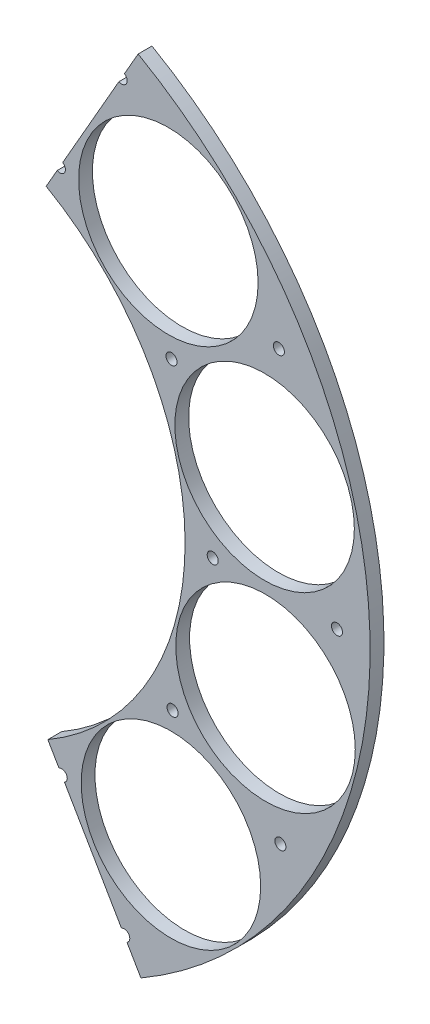
ISO-10303-21;
HEADER;
FILE_DESCRIPTION(('STEP AP214'),'2;1');
FILE_NAME('part.step','',(''),(''),'','','');
FILE_SCHEMA(('AUTOMOTIVE_DESIGN { 1 0 10303 214 1 1 1 1 }'));
ENDSEC;
DATA;
#1=APPLICATION_CONTEXT('core data for automotive mechanical design processes');
#2=APPLICATION_PROTOCOL_DEFINITION('international standard','automotive_design',2000,#1);
#3=PRODUCT_CONTEXT('',#1,'mechanical');
#4=PRODUCT('Part','Part','',(#3));
#5=PRODUCT_RELATED_PRODUCT_CATEGORY('part','',(#4));
#6=PRODUCT_DEFINITION_FORMATION('','',#4);
#7=PRODUCT_DEFINITION_CONTEXT('part definition',#1,'design');
#8=PRODUCT_DEFINITION('design','',#6,#7);
#9=PRODUCT_DEFINITION_SHAPE('','',#8);
#10=(LENGTH_UNIT() NAMED_UNIT(*) SI_UNIT(.MILLI.,.METRE.));
#11=(NAMED_UNIT(*) PLANE_ANGLE_UNIT() SI_UNIT($,.RADIAN.));
#12=(NAMED_UNIT(*) SI_UNIT($,.STERADIAN.) SOLID_ANGLE_UNIT());
#13=UNCERTAINTY_MEASURE_WITH_UNIT(LENGTH_MEASURE(1.E-05),#10,'distance_accuracy_value','');
#14=(GEOMETRIC_REPRESENTATION_CONTEXT(3) GLOBAL_UNCERTAINTY_ASSIGNED_CONTEXT((#13)) GLOBAL_UNIT_ASSIGNED_CONTEXT((#10,
#11,#12)) REPRESENTATION_CONTEXT('',''));
#15=CARTESIAN_POINT('',(0.,0.,0.));
#16=DIRECTION('',(0.,0.,1.));
#17=DIRECTION('',(1.,0.,0.));
#18=AXIS2_PLACEMENT_3D('',#15,#16,#17);
#19=CARTESIAN_POINT('',(0.,0.,5.));
#20=DIRECTION('',(0.,0.,-1.));
#21=DIRECTION('',(-1.,0.,0.));
#22=AXIS2_PLACEMENT_3D('',#19,#20,#21);
#23=CYLINDRICAL_SURFACE('',#22,100.);
#24=DIRECTION('',(0.,0.,-1.));
#25=VECTOR('',#24,1.);
#26=CARTESIAN_POINT('',(50.3013672451077,-86.4278453582687,5.));
#27=LINE('',#26,#25);
#28=CARTESIAN_POINT('',(50.3013672451077,-86.4278453582687,5.));
#29=VERTEX_POINT('',#28);
#30=CARTESIAN_POINT('',(50.3013672451077,-86.4278453582687,0.));
#31=VERTEX_POINT('',#30);
#32=EDGE_CURVE('E462',#29,#31,#27,.T.);
#33=ORIENTED_EDGE('',*,*,#32,.F.);
#34=CARTESIAN_POINT('',(0.,0.,5.));
#35=DIRECTION('',(0.,0.,1.));
#36=DIRECTION('',(1.,0.,0.));
#37=AXIS2_PLACEMENT_3D('',#34,#35,#36);
#38=CIRCLE('',#37,100.);
#39=CARTESIAN_POINT('',(49.6980260520429,86.7761845584978,5.));
#40=VERTEX_POINT('',#39);
#41=EDGE_CURVE('E150',#29,#40,#38,.T.);
#42=ORIENTED_EDGE('',*,*,#41,.T.);
#43=DIRECTION('',(0.,0.,-1.));
#44=VECTOR('',#43,1.);
#45=CARTESIAN_POINT('',(49.6980260520429,86.7761845584978,5.));
#46=LINE('',#45,#44);
#47=CARTESIAN_POINT('',(49.6980260520429,86.7761845584978,0.));
#48=VERTEX_POINT('',#47);
#49=EDGE_CURVE('E455',#48,#40,#46,.F.);
#50=ORIENTED_EDGE('',*,*,#49,.F.);
#51=CARTESIAN_POINT('',(0.,0.,0.));
#52=DIRECTION('',(0.,0.,1.));
#53=DIRECTION('',(1.,0.,0.));
#54=AXIS2_PLACEMENT_3D('',#51,#52,#53);
#55=CIRCLE('',#54,100.);
#56=EDGE_CURVE('E173',#31,#48,#55,.T.);
#57=ORIENTED_EDGE('',*,*,#56,.F.);
#58=EDGE_LOOP('',(#33,#42,#50,#57));
#59=FACE_BOUND('',#58,.T.);
#60=ADVANCED_FACE('F35',(#59),#23,.F.);
#61=CARTESIAN_POINT('',(0.,0.,5.));
#62=DIRECTION('',(0.,0.,-1.));
#63=DIRECTION('',(-1.,0.,0.));
#64=AXIS2_PLACEMENT_3D('',#61,#62,#63);
#65=CYLINDRICAL_SURFACE('',#64,167.);
#66=CARTESIAN_POINT('',(0.,0.,5.));
#67=DIRECTION('',(0.,0.,1.));
#68=DIRECTION('',(1.,0.,0.));
#69=AXIS2_PLACEMENT_3D('',#66,#67,#68);
#70=CIRCLE('',#69,167.);
#71=CARTESIAN_POINT('',(84.0032832993299,-144.334501748309,5.));
#72=VERTEX_POINT('',#71);
#73=CARTESIAN_POINT('',(82.9957035069117,144.916228212691,5.));
#74=VERTEX_POINT('',#73);
#75=EDGE_CURVE('E139',#72,#74,#70,.T.);
#76=ORIENTED_EDGE('',*,*,#75,.F.);
#77=DIRECTION('',(0.,0.,1.));
#78=VECTOR('',#77,1.);
#79=CARTESIAN_POINT('',(84.0032832993299,-144.334501748309,-5.));
#80=LINE('',#79,#78);
#81=CARTESIAN_POINT('',(84.0032832993299,-144.334501748309,0.));
#82=VERTEX_POINT('',#81);
#83=EDGE_CURVE('E142',#82,#72,#80,.T.);
#84=ORIENTED_EDGE('',*,*,#83,.F.);
#85=CARTESIAN_POINT('',(0.,0.,0.));
#86=DIRECTION('',(0.,0.,1.));
#87=DIRECTION('',(1.,0.,0.));
#88=AXIS2_PLACEMENT_3D('',#85,#86,#87);
#89=CIRCLE('',#88,167.);
#90=CARTESIAN_POINT('',(82.9957035069117,144.916228212691,0.));
#91=VERTEX_POINT('',#90);
#92=EDGE_CURVE('E141',#82,#91,#89,.T.);
#93=ORIENTED_EDGE('',*,*,#92,.T.);
#94=DIRECTION('',(0.,0.,1.));
#95=VECTOR('',#94,1.);
#96=CARTESIAN_POINT('',(82.9957035069117,144.916228212691,-5.));
#97=LINE('',#96,#95);
#98=EDGE_CURVE('E125',#91,#74,#97,.T.);
#99=ORIENTED_EDGE('',*,*,#98,.T.);
#100=EDGE_LOOP('',(#76,#84,#93,#99));
#101=FACE_BOUND('',#100,.T.);
#102=ADVANCED_FACE('F137',(#101),#65,.T.);
#103=CARTESIAN_POINT('',(93.9366334350793,94.8586258538758,5.));
#104=DIRECTION('',(0.,0.,-1.));
#105=DIRECTION('',(-1.,0.,0.));
#106=AXIS2_PLACEMENT_3D('',#103,#104,#105);
#107=CYLINDRICAL_SURFACE('',#106,32.5);
#108=CARTESIAN_POINT('',(93.9366334350793,94.8586258538758,5.));
#109=DIRECTION('',(0.,0.,1.));
#110=DIRECTION('',(1.,0.,0.));
#111=AXIS2_PLACEMENT_3D('',#108,#109,#110);
#112=CIRCLE('',#111,32.5);
#113=CARTESIAN_POINT('',(126.436633435079,94.8586258538758,5.));
#114=VERTEX_POINT('',#113);
#115=EDGE_CURVE('E156',#114,#114,#112,.T.);
#116=ORIENTED_EDGE('',*,*,#115,.T.);
#117=EDGE_LOOP('',(#116));
#118=FACE_BOUND('',#117,.T.);
#119=CARTESIAN_POINT('',(93.9366334350793,94.8586258538758,0.));
#120=DIRECTION('',(0.,0.,1.));
#121=DIRECTION('',(1.,0.,0.));
#122=AXIS2_PLACEMENT_3D('',#119,#120,#121);
#123=CIRCLE('',#122,32.5);
#124=CARTESIAN_POINT('',(126.436633435079,94.8586258538758,0.));
#125=VERTEX_POINT('',#124);
#126=EDGE_CURVE('E170',#125,#125,#123,.T.);
#127=ORIENTED_EDGE('',*,*,#126,.F.);
#128=EDGE_LOOP('',(#127));
#129=FACE_BOUND('',#128,.T.);
#130=ADVANCED_FACE('F215',(#118,#129),#107,.F.);
#131=CARTESIAN_POINT('',(128.780823827708,35.1816630400083,5.));
#132=DIRECTION('',(0.,0.,-1.));
#133=DIRECTION('',(-1.,0.,0.));
#134=AXIS2_PLACEMENT_3D('',#131,#132,#133);
#135=CYLINDRICAL_SURFACE('',#134,32.5);
#136=CARTESIAN_POINT('',(128.780823827708,35.1816630400083,5.));
#137=DIRECTION('',(0.,0.,1.));
#138=DIRECTION('',(1.,0.,0.));
#139=AXIS2_PLACEMENT_3D('',#136,#137,#138);
#140=CIRCLE('',#139,32.5);
#141=CARTESIAN_POINT('',(161.280823827708,35.1816630400083,5.));
#142=VERTEX_POINT('',#141);
#143=EDGE_CURVE('E210',#142,#142,#140,.T.);
#144=ORIENTED_EDGE('',*,*,#143,.T.);
#145=EDGE_LOOP('',(#144));
#146=FACE_BOUND('',#145,.T.);
#147=CARTESIAN_POINT('',(128.780823827708,35.1816630400083,0.));
#148=DIRECTION('',(0.,0.,1.));
#149=DIRECTION('',(1.,0.,0.));
#150=AXIS2_PLACEMENT_3D('',#147,#148,#149);
#151=CIRCLE('',#150,32.5);
#152=CARTESIAN_POINT('',(161.280823827708,35.1816630400083,0.));
#153=VERTEX_POINT('',#152);
#154=EDGE_CURVE('E167',#153,#153,#151,.T.);
#155=ORIENTED_EDGE('',*,*,#154,.F.);
#156=EDGE_LOOP('',(#155));
#157=FACE_BOUND('',#156,.T.);
#158=ADVANCED_FACE('F241',(#146,#157),#135,.F.);
#159=CARTESIAN_POINT('',(129.11829647509,-33.9221979738126,5.));
#160=DIRECTION('',(0.,0.,-1.));
#161=DIRECTION('',(-1.,0.,0.));
#162=AXIS2_PLACEMENT_3D('',#159,#160,#161);
#163=CYLINDRICAL_SURFACE('',#162,32.5);
#164=CARTESIAN_POINT('',(129.11829647509,-33.9221979738126,5.));
#165=DIRECTION('',(0.,0.,1.));
#166=DIRECTION('',(1.,0.,0.));
#167=AXIS2_PLACEMENT_3D('',#164,#165,#166);
#168=CIRCLE('',#167,32.5);
#169=CARTESIAN_POINT('',(161.61829647509,-33.9221979738126,5.));
#170=VERTEX_POINT('',#169);
#171=EDGE_CURVE('E207',#170,#170,#168,.T.);
#172=ORIENTED_EDGE('',*,*,#171,.T.);
#173=EDGE_LOOP('',(#172));
#174=FACE_BOUND('',#173,.T.);
#175=CARTESIAN_POINT('',(129.11829647509,-33.9221979738126,0.));
#176=DIRECTION('',(0.,0.,1.));
#177=DIRECTION('',(1.,0.,0.));
#178=AXIS2_PLACEMENT_3D('',#175,#176,#177);
#179=CIRCLE('',#178,32.5);
#180=CARTESIAN_POINT('',(161.61829647509,-33.9221979738126,0.));
#181=VERTEX_POINT('',#180);
#182=EDGE_CURVE('E163',#181,#181,#179,.T.);
#183=ORIENTED_EDGE('',*,*,#182,.F.);
#184=EDGE_LOOP('',(#183));
#185=FACE_BOUND('',#184,.T.);
#186=ADVANCED_FACE('F227',(#174,#185),#163,.F.);
#187=CARTESIAN_POINT('',(94.8586258538953,-93.9366334350617,5.));
#188=DIRECTION('',(0.,0.,-1.));
#189=DIRECTION('',(-1.,0.,0.));
#190=AXIS2_PLACEMENT_3D('',#187,#188,#189);
#191=CYLINDRICAL_SURFACE('',#190,32.5);
#192=CARTESIAN_POINT('',(94.8586258538953,-93.9366334350617,5.));
#193=DIRECTION('',(0.,0.,1.));
#194=DIRECTION('',(1.,0.,0.));
#195=AXIS2_PLACEMENT_3D('',#192,#193,#194);
#196=CIRCLE('',#195,32.5);
#197=CARTESIAN_POINT('',(127.358625853895,-93.9366334350617,5.));
#198=VERTEX_POINT('',#197);
#199=EDGE_CURVE('E176',#198,#198,#196,.T.);
#200=ORIENTED_EDGE('',*,*,#199,.T.);
#201=EDGE_LOOP('',(#200));
#202=FACE_BOUND('',#201,.T.);
#203=CARTESIAN_POINT('',(94.8586258538953,-93.9366334350617,0.));
#204=DIRECTION('',(0.,0.,1.));
#205=DIRECTION('',(1.,0.,0.));
#206=AXIS2_PLACEMENT_3D('',#203,#204,#205);
#207=CIRCLE('',#206,32.5);
#208=CARTESIAN_POINT('',(127.358625853895,-93.9366334350617,0.));
#209=VERTEX_POINT('',#208);
#210=EDGE_CURVE('E160',#209,#209,#207,.T.);
#211=ORIENTED_EDGE('',*,*,#210,.F.);
#212=EDGE_LOOP('',(#211));
#213=FACE_BOUND('',#212,.T.);
#214=ADVANCED_FACE('F37',(#202,#213),#191,.F.);
#215=CARTESIAN_POINT('',(0.,0.,5.));
#216=DIRECTION('',(0.,0.,1.));
#217=DIRECTION('',(1.,0.,0.));
#218=AXIS2_PLACEMENT_3D('',#215,#216,#217);
#219=PLANE('',#218);
#220=DIRECTION('',(-0.503013672451077,0.864278453582687,0.));
#221=VECTOR('',#220,1.);
#222=CARTESIAN_POINT('',(77.9671192299083,-133.963160305302,5.));
#223=LINE('',#222,#221);
#224=CARTESIAN_POINT('',(78.9731465748105,-135.691717212467,5.));
#225=VERTEX_POINT('',#224);
#226=EDGE_CURVE('E143',#72,#225,#223,.T.);
#227=ORIENTED_EDGE('',*,*,#226,.F.);
#228=ORIENTED_EDGE('',*,*,#75,.T.);
#229=DIRECTION('',(0.49698026052043,0.867761845584977,0.));
#230=VECTOR('',#229,1.);
#231=CARTESIAN_POINT('',(77.0319403806665,134.503086065672,5.));
#232=LINE('',#231,#230);
#233=CARTESIAN_POINT('',(78.0259009017074,136.238609756841,5.));
#234=VERTEX_POINT('',#233);
#235=EDGE_CURVE('E122',#234,#74,#232,.T.);
#236=ORIENTED_EDGE('',*,*,#235,.F.);
#237=CARTESIAN_POINT('',(77.0319403806665,134.503086065672,5.));
#238=DIRECTION('',(0.,0.,-1.));
#239=DIRECTION('',(-1.,0.,0.));
#240=AXIS2_PLACEMENT_3D('',#237,#238,#239);
#241=CIRCLE('',#240,2.);
#242=CARTESIAN_POINT('',(76.0379798596257,132.767562374502,5.));
#243=VERTEX_POINT('',#242);
#244=EDGE_CURVE('E164',#234,#243,#241,.T.);
#245=ORIENTED_EDGE('',*,*,#244,.T.);
#246=CARTESIAN_POINT('',(55.6617891782881,97.1893267055175,5.));
#247=VERTEX_POINT('',#246);
#248=EDGE_CURVE('E131',#247,#243,#232,.T.);
#249=ORIENTED_EDGE('',*,*,#248,.F.);
#250=CARTESIAN_POINT('',(54.6678286572472,95.4538030143475,5.));
#251=DIRECTION('',(0.,0.,-1.));
#252=DIRECTION('',(-1.,0.,0.));
#253=AXIS2_PLACEMENT_3D('',#250,#251,#252);
#254=CIRCLE('',#253,2.);
#255=CARTESIAN_POINT('',(53.6738681362063,93.7182793231776,5.));
#256=VERTEX_POINT('',#255);
#257=EDGE_CURVE('E186',#247,#256,#254,.T.);
#258=ORIENTED_EDGE('',*,*,#257,.T.);
#259=EDGE_CURVE('E133',#40,#256,#232,.T.);
#260=ORIENTED_EDGE('',*,*,#259,.F.);
#261=ORIENTED_EDGE('',*,*,#41,.F.);
#262=CARTESIAN_POINT('',(54.3254766247077,-93.3420729869153,5.));
#263=VERTEX_POINT('',#262);
#264=EDGE_CURVE('E461',#263,#29,#223,.T.);
#265=ORIENTED_EDGE('',*,*,#264,.F.);
#266=CARTESIAN_POINT('',(55.3315039696023,-95.0706298940851,5.));
#267=DIRECTION('',(0.,0.,-1.));
#268=DIRECTION('',(-1.,0.,0.));
#269=AXIS2_PLACEMENT_3D('',#266,#267,#268);
#270=CIRCLE('',#269,2.);
#271=CARTESIAN_POINT('',(56.337531314512,-96.7991868012461,5.));
#272=VERTEX_POINT('',#271);
#273=EDGE_CURVE('E519',#263,#272,#270,.T.);
#274=ORIENTED_EDGE('',*,*,#273,.T.);
#275=CARTESIAN_POINT('',(76.9610918850062,-132.234603398136,5.));
#276=VERTEX_POINT('',#275);
#277=EDGE_CURVE('E530',#276,#272,#223,.T.);
#278=ORIENTED_EDGE('',*,*,#277,.F.);
#279=CARTESIAN_POINT('',(77.9671192299083,-133.963160305302,5.));
#280=DIRECTION('',(0.,0.,-1.));
#281=DIRECTION('',(-1.,0.,0.));
#282=AXIS2_PLACEMENT_3D('',#279,#280,#281);
#283=CIRCLE('',#282,2.);
#284=EDGE_CURVE('E195',#276,#225,#283,.T.);
#285=ORIENTED_EDGE('',*,*,#284,.T.);
#286=EDGE_LOOP('',(#227,#228,#236,#245,#249,#258,#260,#261,#265,#274,#278,#285));
#287=FACE_BOUND('',#286,.T.);
#288=CARTESIAN_POINT('',(95.0706298940776,55.3315039696296,5.));
#289=DIRECTION('',(0.,0.,-1.));
#290=DIRECTION('',(-1.,0.,0.));
#291=AXIS2_PLACEMENT_3D('',#288,#289,#290);
#292=CIRCLE('',#291,2.);
#293=CARTESIAN_POINT('',(93.0706298940776,55.3315039696296,5.));
#294=VERTEX_POINT('',#293);
#295=EDGE_CURVE('E482',#294,#294,#292,.T.);
#296=ORIENTED_EDGE('',*,*,#295,.T.);
#297=EDGE_LOOP('',(#296));
#298=FACE_BOUND('',#297,.T.);
#299=CARTESIAN_POINT('',(133.963160305294,77.9671192299356,5.));
#300=DIRECTION('',(0.,0.,-1.));
#301=DIRECTION('',(-1.,0.,0.));
#302=AXIS2_PLACEMENT_3D('',#299,#300,#301);
#303=CIRCLE('',#302,2.);
#304=CARTESIAN_POINT('',(131.963160305294,77.9671192299356,5.));
#305=VERTEX_POINT('',#304);
#306=EDGE_CURVE('E489',#305,#305,#303,.T.);
#307=ORIENTED_EDGE('',*,*,#306,.T.);
#308=EDGE_LOOP('',(#307));
#309=FACE_BOUND('',#308,.T.);
#310=CARTESIAN_POINT('',(109.999332626867,0.383173120252509,5.));
#311=DIRECTION('',(0.,0.,-1.));
#312=DIRECTION('',(-1.,0.,0.));
#313=AXIS2_PLACEMENT_3D('',#310,#311,#312);
#314=CIRCLE('',#313,2.);
#315=CARTESIAN_POINT('',(107.999332626867,0.383173120252509,5.));
#316=VERTEX_POINT('',#315);
#317=EDGE_CURVE('E495',#316,#316,#314,.T.);
#318=ORIENTED_EDGE('',*,*,#317,.T.);
#319=EDGE_LOOP('',(#318));
#320=FACE_BOUND('',#319,.T.);
#321=CARTESIAN_POINT('',(154.999059610592,0.539925760359958,5.));
#322=DIRECTION('',(0.,0.,-1.));
#323=DIRECTION('',(-1.,0.,0.));
#324=AXIS2_PLACEMENT_3D('',#321,#322,#323);
#325=CIRCLE('',#324,2.);
#326=CARTESIAN_POINT('',(152.999059610592,0.539925760359958,5.));
#327=VERTEX_POINT('',#326);
#328=EDGE_CURVE('E501',#327,#327,#325,.T.);
#329=ORIENTED_EDGE('',*,*,#328,.T.);
#330=EDGE_LOOP('',(#329));
#331=FACE_BOUND('',#330,.T.);
#332=CARTESIAN_POINT('',(95.4538030143203,-54.6678286572548,5.));
#333=DIRECTION('',(0.,0.,-1.));
#334=DIRECTION('',(-1.,0.,0.));
#335=AXIS2_PLACEMENT_3D('',#332,#333,#334);
#336=CIRCLE('',#335,2.);
#337=CARTESIAN_POINT('',(93.4538030143203,-54.6678286572548,5.));
#338=VERTEX_POINT('',#337);
#339=EDGE_CURVE('E507',#338,#338,#336,.T.);
#340=ORIENTED_EDGE('',*,*,#339,.T.);
#341=EDGE_LOOP('',(#340));
#342=FACE_BOUND('',#341,.T.);
#343=CARTESIAN_POINT('',(134.503086065644,-77.0319403806741,5.));
#344=DIRECTION('',(0.,0.,-1.));
#345=DIRECTION('',(-1.,0.,0.));
#346=AXIS2_PLACEMENT_3D('',#343,#344,#345);
#347=CIRCLE('',#346,2.);
#348=CARTESIAN_POINT('',(132.503086065644,-77.0319403806741,5.));
#349=VERTEX_POINT('',#348);
#350=EDGE_CURVE('E513',#349,#349,#347,.T.);
#351=ORIENTED_EDGE('',*,*,#350,.T.);
#352=EDGE_LOOP('',(#351));
#353=FACE_BOUND('',#352,.T.);
#354=ORIENTED_EDGE('',*,*,#199,.F.);
#355=EDGE_LOOP('',(#354));
#356=FACE_BOUND('',#355,.T.);
#357=ORIENTED_EDGE('',*,*,#171,.F.);
#358=EDGE_LOOP('',(#357));
#359=FACE_BOUND('',#358,.T.);
#360=ORIENTED_EDGE('',*,*,#143,.F.);
#361=EDGE_LOOP('',(#360));
#362=FACE_BOUND('',#361,.T.);
#363=ORIENTED_EDGE('',*,*,#115,.F.);
#364=EDGE_LOOP('',(#363));
#365=FACE_BOUND('',#364,.T.);
#366=ADVANCED_FACE('F146',(#287,#298,#309,#320,#331,#342,#353,#356,#359,#362,#365),#219,.T.);
#367=CARTESIAN_POINT('',(0.,0.,0.));
#368=DIRECTION('',(0.,0.,1.));
#369=DIRECTION('',(1.,0.,0.));
#370=AXIS2_PLACEMENT_3D('',#367,#368,#369);
#371=PLANE('',#370);
#372=CARTESIAN_POINT('',(95.0706298940776,55.3315039696296,0.));
#373=DIRECTION('',(0.,0.,-1.));
#374=DIRECTION('',(-1.,0.,0.));
#375=AXIS2_PLACEMENT_3D('',#372,#373,#374);
#376=CIRCLE('',#375,2.);
#377=CARTESIAN_POINT('',(93.0706298940776,55.3315039696296,0.));
#378=VERTEX_POINT('',#377);
#379=EDGE_CURVE('E486',#378,#378,#376,.T.);
#380=ORIENTED_EDGE('',*,*,#379,.F.);
#381=EDGE_LOOP('',(#380));
#382=FACE_BOUND('',#381,.T.);
#383=CARTESIAN_POINT('',(133.963160305294,77.9671192299356,0.));
#384=DIRECTION('',(0.,0.,-1.));
#385=DIRECTION('',(-1.,0.,0.));
#386=AXIS2_PLACEMENT_3D('',#383,#384,#385);
#387=CIRCLE('',#386,2.);
#388=CARTESIAN_POINT('',(131.963160305294,77.9671192299356,0.));
#389=VERTEX_POINT('',#388);
#390=EDGE_CURVE('E485',#389,#389,#387,.T.);
#391=ORIENTED_EDGE('',*,*,#390,.F.);
#392=EDGE_LOOP('',(#391));
#393=FACE_BOUND('',#392,.T.);
#394=CARTESIAN_POINT('',(109.999332626867,0.383173120252509,0.));
#395=DIRECTION('',(0.,0.,-1.));
#396=DIRECTION('',(-1.,0.,0.));
#397=AXIS2_PLACEMENT_3D('',#394,#395,#396);
#398=CIRCLE('',#397,2.);
#399=CARTESIAN_POINT('',(107.999332626867,0.383173120252509,0.));
#400=VERTEX_POINT('',#399);
#401=EDGE_CURVE('E492',#400,#400,#398,.T.);
#402=ORIENTED_EDGE('',*,*,#401,.F.);
#403=EDGE_LOOP('',(#402));
#404=FACE_BOUND('',#403,.T.);
#405=CARTESIAN_POINT('',(154.999059610592,0.539925760359958,0.));
#406=DIRECTION('',(0.,0.,-1.));
#407=DIRECTION('',(-1.,0.,0.));
#408=AXIS2_PLACEMENT_3D('',#405,#406,#407);
#409=CIRCLE('',#408,2.);
#410=CARTESIAN_POINT('',(152.999059610592,0.539925760359958,0.));
#411=VERTEX_POINT('',#410);
#412=EDGE_CURVE('E498',#411,#411,#409,.T.);
#413=ORIENTED_EDGE('',*,*,#412,.F.);
#414=EDGE_LOOP('',(#413));
#415=FACE_BOUND('',#414,.T.);
#416=CARTESIAN_POINT('',(95.4538030143203,-54.6678286572548,0.));
#417=DIRECTION('',(0.,0.,-1.));
#418=DIRECTION('',(-1.,0.,0.));
#419=AXIS2_PLACEMENT_3D('',#416,#417,#418);
#420=CIRCLE('',#419,2.);
#421=CARTESIAN_POINT('',(93.4538030143203,-54.6678286572548,0.));
#422=VERTEX_POINT('',#421);
#423=EDGE_CURVE('E504',#422,#422,#420,.T.);
#424=ORIENTED_EDGE('',*,*,#423,.F.);
#425=EDGE_LOOP('',(#424));
#426=FACE_BOUND('',#425,.T.);
#427=CARTESIAN_POINT('',(134.503086065644,-77.0319403806741,0.));
#428=DIRECTION('',(0.,0.,-1.));
#429=DIRECTION('',(-1.,0.,0.));
#430=AXIS2_PLACEMENT_3D('',#427,#428,#429);
#431=CIRCLE('',#430,2.);
#432=CARTESIAN_POINT('',(132.503086065644,-77.0319403806741,0.));
#433=VERTEX_POINT('',#432);
#434=EDGE_CURVE('E510',#433,#433,#431,.T.);
#435=ORIENTED_EDGE('',*,*,#434,.F.);
#436=EDGE_LOOP('',(#435));
#437=FACE_BOUND('',#436,.T.);
#438=ORIENTED_EDGE('',*,*,#92,.F.);
#439=DIRECTION('',(-0.503013672451077,0.864278453582687,0.));
#440=VECTOR('',#439,1.);
#441=CARTESIAN_POINT('',(0.,0.,0.));
#442=LINE('',#441,#440);
#443=CARTESIAN_POINT('',(78.9731465748105,-135.691717212467,0.));
#444=VERTEX_POINT('',#443);
#445=EDGE_CURVE('E470',#82,#444,#442,.T.);
#446=ORIENTED_EDGE('',*,*,#445,.T.);
#447=CARTESIAN_POINT('',(77.9671192299083,-133.963160305302,0.));
#448=DIRECTION('',(0.,0.,-1.));
#449=DIRECTION('',(-1.,0.,0.));
#450=AXIS2_PLACEMENT_3D('',#447,#448,#449);
#451=CIRCLE('',#450,2.);
#452=CARTESIAN_POINT('',(76.9610918850062,-132.234603398136,0.));
#453=VERTEX_POINT('',#452);
#454=EDGE_CURVE('E199',#453,#444,#451,.T.);
#455=ORIENTED_EDGE('',*,*,#454,.F.);
#456=CARTESIAN_POINT('',(56.337531314512,-96.7991868012461,0.));
#457=VERTEX_POINT('',#456);
#458=EDGE_CURVE('E464',#453,#457,#442,.T.);
#459=ORIENTED_EDGE('',*,*,#458,.T.);
#460=CARTESIAN_POINT('',(55.3315039696023,-95.0706298940851,0.));
#461=DIRECTION('',(0.,0.,-1.));
#462=DIRECTION('',(-1.,0.,0.));
#463=AXIS2_PLACEMENT_3D('',#460,#461,#462);
#464=CIRCLE('',#463,2.);
#465=CARTESIAN_POINT('',(54.3254766247077,-93.3420729869153,0.));
#466=VERTEX_POINT('',#465);
#467=EDGE_CURVE('E516',#466,#457,#464,.T.);
#468=ORIENTED_EDGE('',*,*,#467,.F.);
#469=EDGE_CURVE('E465',#466,#31,#442,.T.);
#470=ORIENTED_EDGE('',*,*,#469,.T.);
#471=ORIENTED_EDGE('',*,*,#56,.T.);
#472=DIRECTION('',(0.49698026052043,0.867761845584977,0.));
#473=VECTOR('',#472,1.);
#474=CARTESIAN_POINT('',(0.,0.,0.));
#475=LINE('',#474,#473);
#476=CARTESIAN_POINT('',(53.6738681362063,93.7182793231776,0.));
#477=VERTEX_POINT('',#476);
#478=EDGE_CURVE('E194',#48,#477,#475,.T.);
#479=ORIENTED_EDGE('',*,*,#478,.T.);
#480=CARTESIAN_POINT('',(54.6678286572472,95.4538030143475,0.));
#481=DIRECTION('',(0.,0.,-1.));
#482=DIRECTION('',(-1.,0.,0.));
#483=AXIS2_PLACEMENT_3D('',#480,#481,#482);
#484=CIRCLE('',#483,2.);
#485=CARTESIAN_POINT('',(55.6617891782881,97.1893267055175,0.));
#486=VERTEX_POINT('',#485);
#487=EDGE_CURVE('E184',#486,#477,#484,.T.);
#488=ORIENTED_EDGE('',*,*,#487,.F.);
#489=CARTESIAN_POINT('',(76.0379798596257,132.767562374502,0.));
#490=VERTEX_POINT('',#489);
#491=EDGE_CURVE('E58',#486,#490,#475,.T.);
#492=ORIENTED_EDGE('',*,*,#491,.T.);
#493=CARTESIAN_POINT('',(77.0319403806665,134.503086065672,0.));
#494=DIRECTION('',(0.,0.,-1.));
#495=DIRECTION('',(-1.,0.,0.));
#496=AXIS2_PLACEMENT_3D('',#493,#494,#495);
#497=CIRCLE('',#496,2.);
#498=CARTESIAN_POINT('',(78.0259009017074,136.238609756841,0.));
#499=VERTEX_POINT('',#498);
#500=EDGE_CURVE('E197',#499,#490,#497,.T.);
#501=ORIENTED_EDGE('',*,*,#500,.F.);
#502=EDGE_CURVE('E50',#499,#91,#475,.T.);
#503=ORIENTED_EDGE('',*,*,#502,.T.);
#504=EDGE_LOOP('',(#438,#446,#455,#459,#468,#470,#471,#479,#488,#492,#501,#503));
#505=FACE_BOUND('',#504,.T.);
#506=ORIENTED_EDGE('',*,*,#210,.T.);
#507=EDGE_LOOP('',(#506));
#508=FACE_BOUND('',#507,.T.);
#509=ORIENTED_EDGE('',*,*,#182,.T.);
#510=EDGE_LOOP('',(#509));
#511=FACE_BOUND('',#510,.T.);
#512=ORIENTED_EDGE('',*,*,#154,.T.);
#513=EDGE_LOOP('',(#512));
#514=FACE_BOUND('',#513,.T.);
#515=ORIENTED_EDGE('',*,*,#126,.T.);
#516=EDGE_LOOP('',(#515));
#517=FACE_BOUND('',#516,.T.);
#518=ADVANCED_FACE('F190',(#382,#393,#404,#415,#426,#437,#505,#508,#511,#514,#517),#371,.F.);
#519=CARTESIAN_POINT('',(77.0319403806665,134.503086065672,5.));
#520=DIRECTION('',(0.,0.,-1.));
#521=DIRECTION('',(-1.,0.,0.));
#522=AXIS2_PLACEMENT_3D('',#519,#520,#521);
#523=CYLINDRICAL_SURFACE('',#522,2.);
#524=ORIENTED_EDGE('',*,*,#500,.T.);
#525=DIRECTION('',(0.,0.,-1.));
#526=VECTOR('',#525,1.);
#527=CARTESIAN_POINT('',(76.0379798596257,132.767562374502,5.));
#528=LINE('',#527,#526);
#529=EDGE_CURVE('E478',#490,#243,#528,.F.);
#530=ORIENTED_EDGE('',*,*,#529,.T.);
#531=ORIENTED_EDGE('',*,*,#244,.F.);
#532=DIRECTION('',(0.,0.,-1.));
#533=VECTOR('',#532,1.);
#534=CARTESIAN_POINT('',(78.0259009017074,136.238609756841,5.));
#535=LINE('',#534,#533);
#536=EDGE_CURVE('E126',#234,#499,#535,.T.);
#537=ORIENTED_EDGE('',*,*,#536,.T.);
#538=EDGE_LOOP('',(#524,#530,#531,#537));
#539=FACE_BOUND('',#538,.T.);
#540=ADVANCED_FACE('F224',(#539),#523,.F.);
#541=CARTESIAN_POINT('',(54.6678286572472,95.4538030143475,5.));
#542=DIRECTION('',(0.,0.,-1.));
#543=DIRECTION('',(-1.,0.,0.));
#544=AXIS2_PLACEMENT_3D('',#541,#542,#543);
#545=CYLINDRICAL_SURFACE('',#544,2.);
#546=ORIENTED_EDGE('',*,*,#487,.T.);
#547=DIRECTION('',(0.,0.,-1.));
#548=VECTOR('',#547,1.);
#549=CARTESIAN_POINT('',(53.6738681362063,93.7182793231776,5.));
#550=LINE('',#549,#548);
#551=EDGE_CURVE('E11',#477,#256,#550,.F.);
#552=ORIENTED_EDGE('',*,*,#551,.T.);
#553=ORIENTED_EDGE('',*,*,#257,.F.);
#554=DIRECTION('',(0.,0.,-1.));
#555=VECTOR('',#554,1.);
#556=CARTESIAN_POINT('',(55.6617891782881,97.1893267055175,5.));
#557=LINE('',#556,#555);
#558=EDGE_CURVE('E43',#247,#486,#557,.T.);
#559=ORIENTED_EDGE('',*,*,#558,.T.);
#560=EDGE_LOOP('',(#546,#552,#553,#559));
#561=FACE_BOUND('',#560,.T.);
#562=ADVANCED_FACE('F183',(#561),#545,.F.);
#563=CARTESIAN_POINT('',(77.9671192299083,-133.963160305302,5.));
#564=DIRECTION('',(0.,0.,-1.));
#565=DIRECTION('',(-1.,0.,0.));
#566=AXIS2_PLACEMENT_3D('',#563,#564,#565);
#567=CYLINDRICAL_SURFACE('',#566,2.);
#568=ORIENTED_EDGE('',*,*,#454,.T.);
#569=DIRECTION('',(0.,0.,-1.));
#570=VECTOR('',#569,1.);
#571=CARTESIAN_POINT('',(78.9731465748105,-135.691717212467,5.));
#572=LINE('',#571,#570);
#573=EDGE_CURVE('E474',#444,#225,#572,.F.);
#574=ORIENTED_EDGE('',*,*,#573,.T.);
#575=ORIENTED_EDGE('',*,*,#284,.F.);
#576=DIRECTION('',(0.,0.,-1.));
#577=VECTOR('',#576,1.);
#578=CARTESIAN_POINT('',(76.9610918850062,-132.234603398136,5.));
#579=LINE('',#578,#577);
#580=EDGE_CURVE('E468',#276,#453,#579,.T.);
#581=ORIENTED_EDGE('',*,*,#580,.T.);
#582=EDGE_LOOP('',(#568,#574,#575,#581));
#583=FACE_BOUND('',#582,.T.);
#584=ADVANCED_FACE('F374',(#583),#567,.F.);
#585=CARTESIAN_POINT('',(55.3315039696023,-95.0706298940851,5.));
#586=DIRECTION('',(0.,0.,-1.));
#587=DIRECTION('',(-1.,0.,0.));
#588=AXIS2_PLACEMENT_3D('',#585,#586,#587);
#589=CYLINDRICAL_SURFACE('',#588,2.);
#590=ORIENTED_EDGE('',*,*,#467,.T.);
#591=DIRECTION('',(0.,0.,-1.));
#592=VECTOR('',#591,1.);
#593=CARTESIAN_POINT('',(56.337531314512,-96.7991868012461,5.));
#594=LINE('',#593,#592);
#595=EDGE_CURVE('E153',#457,#272,#594,.F.);
#596=ORIENTED_EDGE('',*,*,#595,.T.);
#597=ORIENTED_EDGE('',*,*,#273,.F.);
#598=DIRECTION('',(0.,0.,-1.));
#599=VECTOR('',#598,1.);
#600=CARTESIAN_POINT('',(54.3254766247077,-93.3420729869153,5.));
#601=LINE('',#600,#599);
#602=EDGE_CURVE('E149',#263,#466,#601,.T.);
#603=ORIENTED_EDGE('',*,*,#602,.T.);
#604=EDGE_LOOP('',(#590,#596,#597,#603));
#605=FACE_BOUND('',#604,.T.);
#606=ADVANCED_FACE('F278',(#605),#589,.F.);
#607=CARTESIAN_POINT('',(134.503086065644,-77.0319403806741,5.));
#608=DIRECTION('',(0.,0.,-1.));
#609=DIRECTION('',(-1.,0.,0.));
#610=AXIS2_PLACEMENT_3D('',#607,#608,#609);
#611=CYLINDRICAL_SURFACE('',#610,2.);
#612=ORIENTED_EDGE('',*,*,#350,.F.);
#613=EDGE_LOOP('',(#612));
#614=FACE_BOUND('',#613,.T.);
#615=ORIENTED_EDGE('',*,*,#434,.T.);
#616=EDGE_LOOP('',(#615));
#617=FACE_BOUND('',#616,.T.);
#618=ADVANCED_FACE('F272',(#614,#617),#611,.F.);
#619=CARTESIAN_POINT('',(95.4538030143203,-54.6678286572548,5.));
#620=DIRECTION('',(0.,0.,-1.));
#621=DIRECTION('',(-1.,0.,0.));
#622=AXIS2_PLACEMENT_3D('',#619,#620,#621);
#623=CYLINDRICAL_SURFACE('',#622,2.);
#624=ORIENTED_EDGE('',*,*,#339,.F.);
#625=EDGE_LOOP('',(#624));
#626=FACE_BOUND('',#625,.T.);
#627=ORIENTED_EDGE('',*,*,#423,.T.);
#628=EDGE_LOOP('',(#627));
#629=FACE_BOUND('',#628,.T.);
#630=ADVANCED_FACE('F277',(#626,#629),#623,.F.);
#631=CARTESIAN_POINT('',(154.999059610592,0.539925760359958,5.));
#632=DIRECTION('',(0.,0.,-1.));
#633=DIRECTION('',(-1.,0.,0.));
#634=AXIS2_PLACEMENT_3D('',#631,#632,#633);
#635=CYLINDRICAL_SURFACE('',#634,2.);
#636=ORIENTED_EDGE('',*,*,#328,.F.);
#637=EDGE_LOOP('',(#636));
#638=FACE_BOUND('',#637,.T.);
#639=ORIENTED_EDGE('',*,*,#412,.T.);
#640=EDGE_LOOP('',(#639));
#641=FACE_BOUND('',#640,.T.);
#642=ADVANCED_FACE('F290',(#638,#641),#635,.F.);
#643=CARTESIAN_POINT('',(109.999332626867,0.383173120252509,5.));
#644=DIRECTION('',(0.,0.,-1.));
#645=DIRECTION('',(-1.,0.,0.));
#646=AXIS2_PLACEMENT_3D('',#643,#644,#645);
#647=CYLINDRICAL_SURFACE('',#646,2.);
#648=ORIENTED_EDGE('',*,*,#317,.F.);
#649=EDGE_LOOP('',(#648));
#650=FACE_BOUND('',#649,.T.);
#651=ORIENTED_EDGE('',*,*,#401,.T.);
#652=EDGE_LOOP('',(#651));
#653=FACE_BOUND('',#652,.T.);
#654=ADVANCED_FACE('F300',(#650,#653),#647,.F.);
#655=CARTESIAN_POINT('',(133.963160305294,77.9671192299356,5.));
#656=DIRECTION('',(0.,0.,-1.));
#657=DIRECTION('',(-1.,0.,0.));
#658=AXIS2_PLACEMENT_3D('',#655,#656,#657);
#659=CYLINDRICAL_SURFACE('',#658,2.);
#660=ORIENTED_EDGE('',*,*,#306,.F.);
#661=EDGE_LOOP('',(#660));
#662=FACE_BOUND('',#661,.T.);
#663=ORIENTED_EDGE('',*,*,#390,.T.);
#664=EDGE_LOOP('',(#663));
#665=FACE_BOUND('',#664,.T.);
#666=ADVANCED_FACE('F310',(#662,#665),#659,.F.);
#667=CARTESIAN_POINT('',(95.0706298940776,55.3315039696296,5.));
#668=DIRECTION('',(0.,0.,-1.));
#669=DIRECTION('',(-1.,0.,0.));
#670=AXIS2_PLACEMENT_3D('',#667,#668,#669);
#671=CYLINDRICAL_SURFACE('',#670,2.);
#672=ORIENTED_EDGE('',*,*,#295,.F.);
#673=EDGE_LOOP('',(#672));
#674=FACE_BOUND('',#673,.T.);
#675=ORIENTED_EDGE('',*,*,#379,.T.);
#676=EDGE_LOOP('',(#675));
#677=FACE_BOUND('',#676,.T.);
#678=ADVANCED_FACE('F320',(#674,#677),#671,.F.);
#679=CARTESIAN_POINT('',(77.9671192299083,-133.963160305302,-5.));
#680=DIRECTION('',(0.864278453582687,0.503013672451077,0.));
#681=DIRECTION('',(-0.503013672451077,0.864278453582687,0.));
#682=AXIS2_PLACEMENT_3D('',#679,#680,#681);
#683=PLANE('',#682);
#684=ORIENTED_EDGE('',*,*,#32,.T.);
#685=ORIENTED_EDGE('',*,*,#469,.F.);
#686=ORIENTED_EDGE('',*,*,#602,.F.);
#687=ORIENTED_EDGE('',*,*,#264,.T.);
#688=EDGE_LOOP('',(#684,#685,#686,#687));
#689=FACE_BOUND('',#688,.T.);
#690=ADVANCED_FACE('F329',(#689),#683,.F.);
#691=ORIENTED_EDGE('',*,*,#277,.T.);
#692=ORIENTED_EDGE('',*,*,#595,.F.);
#693=ORIENTED_EDGE('',*,*,#458,.F.);
#694=ORIENTED_EDGE('',*,*,#580,.F.);
#695=EDGE_LOOP('',(#691,#692,#693,#694));
#696=FACE_BOUND('',#695,.T.);
#697=ADVANCED_FACE('F398',(#696),#683,.F.);
#698=ORIENTED_EDGE('',*,*,#83,.T.);
#699=ORIENTED_EDGE('',*,*,#226,.T.);
#700=ORIENTED_EDGE('',*,*,#573,.F.);
#701=ORIENTED_EDGE('',*,*,#445,.F.);
#702=EDGE_LOOP('',(#698,#699,#700,#701));
#703=FACE_BOUND('',#702,.T.);
#704=ADVANCED_FACE('F401',(#703),#683,.F.);
#705=CARTESIAN_POINT('',(77.0319403806665,134.503086065672,-5.));
#706=DIRECTION('',(0.867761845584977,-0.49698026052043,0.));
#707=DIRECTION('',(0.49698026052043,0.867761845584977,0.));
#708=AXIS2_PLACEMENT_3D('',#705,#706,#707);
#709=PLANE('',#708);
#710=ORIENTED_EDGE('',*,*,#491,.F.);
#711=ORIENTED_EDGE('',*,*,#558,.F.);
#712=ORIENTED_EDGE('',*,*,#248,.T.);
#713=ORIENTED_EDGE('',*,*,#529,.F.);
#714=EDGE_LOOP('',(#710,#711,#712,#713));
#715=FACE_BOUND('',#714,.T.);
#716=ADVANCED_FACE('F419',(#715),#709,.F.);
#717=ORIENTED_EDGE('',*,*,#49,.T.);
#718=ORIENTED_EDGE('',*,*,#259,.T.);
#719=ORIENTED_EDGE('',*,*,#551,.F.);
#720=ORIENTED_EDGE('',*,*,#478,.F.);
#721=EDGE_LOOP('',(#717,#718,#719,#720));
#722=FACE_BOUND('',#721,.T.);
#723=ADVANCED_FACE('F429',(#722),#709,.F.);
#724=ORIENTED_EDGE('',*,*,#536,.F.);
#725=ORIENTED_EDGE('',*,*,#235,.T.);
#726=ORIENTED_EDGE('',*,*,#98,.F.);
#727=ORIENTED_EDGE('',*,*,#502,.F.);
#728=EDGE_LOOP('',(#724,#725,#726,#727));
#729=FACE_BOUND('',#728,.T.);
#730=ADVANCED_FACE('F124',(#729),#709,.F.);
#731=CLOSED_SHELL('',(#60,#102,#130,#158,#186,#214,#366,#518,#540,#562,#584,#606,#618,#630,#642,
#654,#666,#678,#690,#697,#704,#716,#723,#730));
#732=MANIFOLD_SOLID_BREP('B2',#731);
#733=ADVANCED_BREP_SHAPE_REPRESENTATION('',(#18,#732),#14);
#734=SHAPE_DEFINITION_REPRESENTATION(#9,#733);
ENDSEC;
END-ISO-10303-21;
